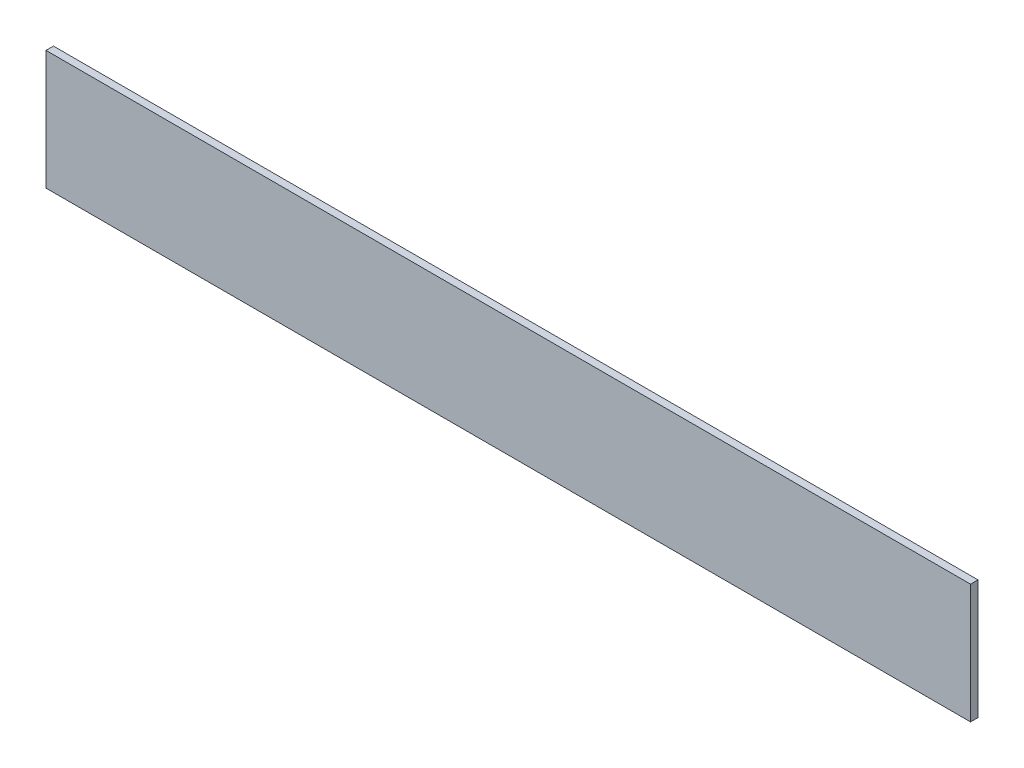
ISO-10303-21;
HEADER;
FILE_DESCRIPTION(('STEP AP214'),'2;1');
FILE_NAME('part.step','',(''),(''),'','','');
FILE_SCHEMA(('AUTOMOTIVE_DESIGN { 1 0 10303 214 1 1 1 1 }'));
ENDSEC;
DATA;
#1=APPLICATION_CONTEXT('core data for automotive mechanical design processes');
#2=APPLICATION_PROTOCOL_DEFINITION('international standard','automotive_design',2000,#1);
#3=PRODUCT_CONTEXT('',#1,'mechanical');
#4=PRODUCT('Part','Part','',(#3));
#5=PRODUCT_RELATED_PRODUCT_CATEGORY('part','',(#4));
#6=PRODUCT_DEFINITION_FORMATION('','',#4);
#7=PRODUCT_DEFINITION_CONTEXT('part definition',#1,'design');
#8=PRODUCT_DEFINITION('design','',#6,#7);
#9=PRODUCT_DEFINITION_SHAPE('','',#8);
#10=(LENGTH_UNIT() NAMED_UNIT(*) SI_UNIT(.MILLI.,.METRE.));
#11=(NAMED_UNIT(*) PLANE_ANGLE_UNIT() SI_UNIT($,.RADIAN.));
#12=(NAMED_UNIT(*) SI_UNIT($,.STERADIAN.) SOLID_ANGLE_UNIT());
#13=UNCERTAINTY_MEASURE_WITH_UNIT(LENGTH_MEASURE(1.E-05),#10,'distance_accuracy_value','');
#14=(GEOMETRIC_REPRESENTATION_CONTEXT(3) GLOBAL_UNCERTAINTY_ASSIGNED_CONTEXT((#13)) GLOBAL_UNIT_ASSIGNED_CONTEXT((#10,
#11,#12)) REPRESENTATION_CONTEXT('',''));
#15=CARTESIAN_POINT('',(0.,0.,0.));
#16=DIRECTION('',(0.,0.,1.));
#17=DIRECTION('',(1.,0.,0.));
#18=AXIS2_PLACEMENT_3D('',#15,#16,#17);
#19=CARTESIAN_POINT('',(0.,0.,3.175));
#20=DIRECTION('',(1.,0.,0.));
#21=DIRECTION('',(0.,0.,-1.));
#22=AXIS2_PLACEMENT_3D('',#19,#20,#21);
#23=PLANE('',#22);
#24=DIRECTION('',(0.,-1.,0.));
#25=VECTOR('',#24,1.);
#26=CARTESIAN_POINT('',(0.,0.,0.));
#27=LINE('',#26,#25);
#28=CARTESIAN_POINT('',(0.,50.8,0.));
#29=VERTEX_POINT('',#28);
#30=CARTESIAN_POINT('',(0.,0.,0.));
#31=VERTEX_POINT('',#30);
#32=EDGE_CURVE('E96',#29,#31,#27,.T.);
#33=ORIENTED_EDGE('',*,*,#32,.T.);
#34=DIRECTION('',(0.,0.,-1.));
#35=VECTOR('',#34,1.);
#36=CARTESIAN_POINT('',(0.,0.,3.175));
#37=LINE('',#36,#35);
#38=CARTESIAN_POINT('',(0.,0.,3.175));
#39=VERTEX_POINT('',#38);
#40=EDGE_CURVE('E11',#39,#31,#37,.T.);
#41=ORIENTED_EDGE('',*,*,#40,.F.);
#42=DIRECTION('',(0.,-1.,0.));
#43=VECTOR('',#42,1.);
#44=CARTESIAN_POINT('',(0.,0.,3.175));
#45=LINE('',#44,#43);
#46=CARTESIAN_POINT('',(0.,50.8,3.175));
#47=VERTEX_POINT('',#46);
#48=EDGE_CURVE('E84',#47,#39,#45,.T.);
#49=ORIENTED_EDGE('',*,*,#48,.F.);
#50=DIRECTION('',(0.,0.,-1.));
#51=VECTOR('',#50,1.);
#52=CARTESIAN_POINT('',(0.,50.8,3.175));
#53=LINE('',#52,#51);
#54=EDGE_CURVE('E92',#47,#29,#53,.T.);
#55=ORIENTED_EDGE('',*,*,#54,.T.);
#56=EDGE_LOOP('',(#33,#41,#49,#55));
#57=FACE_BOUND('',#56,.T.);
#58=ADVANCED_FACE('F33',(#57),#23,.F.);
#59=CARTESIAN_POINT('',(0.,0.,3.175));
#60=DIRECTION('',(0.,1.,0.));
#61=DIRECTION('',(0.,0.,1.));
#62=AXIS2_PLACEMENT_3D('',#59,#60,#61);
#63=PLANE('',#62);
#64=DIRECTION('',(1.,0.,0.));
#65=VECTOR('',#64,1.);
#66=CARTESIAN_POINT('',(0.,0.,0.));
#67=LINE('',#66,#65);
#68=CARTESIAN_POINT('',(393.7,0.,0.));
#69=VERTEX_POINT('',#68);
#70=EDGE_CURVE('E88',#31,#69,#67,.T.);
#71=ORIENTED_EDGE('',*,*,#70,.T.);
#72=DIRECTION('',(0.,0.,-1.));
#73=VECTOR('',#72,1.);
#74=CARTESIAN_POINT('',(393.7,0.,3.175));
#75=LINE('',#74,#73);
#76=CARTESIAN_POINT('',(393.7,0.,3.175));
#77=VERTEX_POINT('',#76);
#78=EDGE_CURVE('E41',#77,#69,#75,.T.);
#79=ORIENTED_EDGE('',*,*,#78,.F.);
#80=DIRECTION('',(1.,0.,0.));
#81=VECTOR('',#80,1.);
#82=CARTESIAN_POINT('',(0.,0.,3.175));
#83=LINE('',#82,#81);
#84=EDGE_CURVE('E79',#39,#77,#83,.T.);
#85=ORIENTED_EDGE('',*,*,#84,.F.);
#86=ORIENTED_EDGE('',*,*,#40,.T.);
#87=EDGE_LOOP('',(#71,#79,#85,#86));
#88=FACE_BOUND('',#87,.T.);
#89=ADVANCED_FACE('F87',(#88),#63,.F.);
#90=CARTESIAN_POINT('',(393.7,0.,3.175));
#91=DIRECTION('',(-1.,0.,0.));
#92=DIRECTION('',(0.,0.,1.));
#93=AXIS2_PLACEMENT_3D('',#90,#91,#92);
#94=PLANE('',#93);
#95=DIRECTION('',(0.,1.,0.));
#96=VECTOR('',#95,1.);
#97=CARTESIAN_POINT('',(393.7,0.,0.));
#98=LINE('',#97,#96);
#99=CARTESIAN_POINT('',(393.7,50.8,0.));
#100=VERTEX_POINT('',#99);
#101=EDGE_CURVE('E66',#69,#100,#98,.T.);
#102=ORIENTED_EDGE('',*,*,#101,.T.);
#103=DIRECTION('',(0.,0.,-1.));
#104=VECTOR('',#103,1.);
#105=CARTESIAN_POINT('',(393.7,50.8,3.175));
#106=LINE('',#105,#104);
#107=CARTESIAN_POINT('',(393.7,50.8,3.175));
#108=VERTEX_POINT('',#107);
#109=EDGE_CURVE('E89',#108,#100,#106,.T.);
#110=ORIENTED_EDGE('',*,*,#109,.F.);
#111=DIRECTION('',(0.,1.,0.));
#112=VECTOR('',#111,1.);
#113=CARTESIAN_POINT('',(393.7,0.,3.175));
#114=LINE('',#113,#112);
#115=EDGE_CURVE('E82',#77,#108,#114,.T.);
#116=ORIENTED_EDGE('',*,*,#115,.F.);
#117=ORIENTED_EDGE('',*,*,#78,.T.);
#118=EDGE_LOOP('',(#102,#110,#116,#117));
#119=FACE_BOUND('',#118,.T.);
#120=ADVANCED_FACE('F90',(#119),#94,.F.);
#121=CARTESIAN_POINT('',(0.,50.8,3.175));
#122=DIRECTION('',(0.,-1.,0.));
#123=DIRECTION('',(0.,0.,-1.));
#124=AXIS2_PLACEMENT_3D('',#121,#122,#123);
#125=PLANE('',#124);
#126=DIRECTION('',(-1.,0.,0.));
#127=VECTOR('',#126,1.);
#128=CARTESIAN_POINT('',(0.,50.8,0.));
#129=LINE('',#128,#127);
#130=EDGE_CURVE('E72',#100,#29,#129,.T.);
#131=ORIENTED_EDGE('',*,*,#130,.T.);
#132=ORIENTED_EDGE('',*,*,#54,.F.);
#133=DIRECTION('',(-1.,0.,0.));
#134=VECTOR('',#133,1.);
#135=CARTESIAN_POINT('',(0.,50.8,3.175));
#136=LINE('',#135,#134);
#137=EDGE_CURVE('E49',#108,#47,#136,.T.);
#138=ORIENTED_EDGE('',*,*,#137,.F.);
#139=ORIENTED_EDGE('',*,*,#109,.T.);
#140=EDGE_LOOP('',(#131,#132,#138,#139));
#141=FACE_BOUND('',#140,.T.);
#142=ADVANCED_FACE('F103',(#141),#125,.F.);
#143=CARTESIAN_POINT('',(0.,0.,3.175));
#144=DIRECTION('',(0.,0.,-1.));
#145=DIRECTION('',(-1.,0.,0.));
#146=AXIS2_PLACEMENT_3D('',#143,#144,#145);
#147=PLANE('',#146);
#148=ORIENTED_EDGE('',*,*,#48,.T.);
#149=ORIENTED_EDGE('',*,*,#84,.T.);
#150=ORIENTED_EDGE('',*,*,#115,.T.);
#151=ORIENTED_EDGE('',*,*,#137,.T.);
#152=EDGE_LOOP('',(#148,#149,#150,#151));
#153=FACE_BOUND('',#152,.T.);
#154=ADVANCED_FACE('F80',(#153),#147,.F.);
#155=CARTESIAN_POINT('',(0.,0.,0.));
#156=DIRECTION('',(0.,0.,-1.));
#157=DIRECTION('',(-1.,0.,0.));
#158=AXIS2_PLACEMENT_3D('',#155,#156,#157);
#159=PLANE('',#158);
#160=ORIENTED_EDGE('',*,*,#32,.F.);
#161=ORIENTED_EDGE('',*,*,#130,.F.);
#162=ORIENTED_EDGE('',*,*,#101,.F.);
#163=ORIENTED_EDGE('',*,*,#70,.F.);
#164=EDGE_LOOP('',(#160,#161,#162,#163));
#165=FACE_BOUND('',#164,.T.);
#166=ADVANCED_FACE('F106',(#165),#159,.T.);
#167=CLOSED_SHELL('',(#58,#89,#120,#142,#154,#166));
#168=MANIFOLD_SOLID_BREP('B2',#167);
#169=ADVANCED_BREP_SHAPE_REPRESENTATION('',(#18,#168),#14);
#170=SHAPE_DEFINITION_REPRESENTATION(#9,#169);
ENDSEC;
END-ISO-10303-21;
